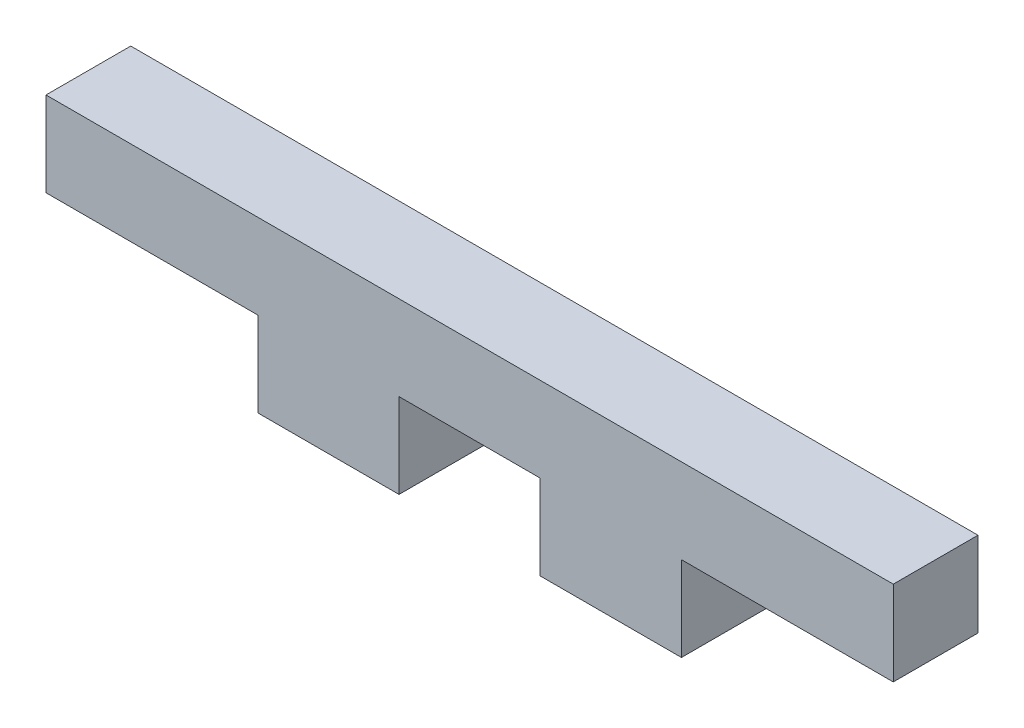
ISO-10303-21;
HEADER;
FILE_DESCRIPTION(('STEP AP214'),'2;1');
FILE_NAME('part.step','',(''),(''),'','','');
FILE_SCHEMA(('AUTOMOTIVE_DESIGN { 1 0 10303 214 1 1 1 1 }'));
ENDSEC;
DATA;
#1=APPLICATION_CONTEXT('core data for automotive mechanical design processes');
#2=APPLICATION_PROTOCOL_DEFINITION('international standard','automotive_design',2000,#1);
#3=PRODUCT_CONTEXT('',#1,'mechanical');
#4=PRODUCT('Part','Part','',(#3));
#5=PRODUCT_RELATED_PRODUCT_CATEGORY('part','',(#4));
#6=PRODUCT_DEFINITION_FORMATION('','',#4);
#7=PRODUCT_DEFINITION_CONTEXT('part definition',#1,'design');
#8=PRODUCT_DEFINITION('design','',#6,#7);
#9=PRODUCT_DEFINITION_SHAPE('','',#8);
#10=(LENGTH_UNIT() NAMED_UNIT(*) SI_UNIT(.MILLI.,.METRE.));
#11=(NAMED_UNIT(*) PLANE_ANGLE_UNIT() SI_UNIT($,.RADIAN.));
#12=(NAMED_UNIT(*) SI_UNIT($,.STERADIAN.) SOLID_ANGLE_UNIT());
#13=UNCERTAINTY_MEASURE_WITH_UNIT(LENGTH_MEASURE(1.E-05),#10,'distance_accuracy_value','');
#14=(GEOMETRIC_REPRESENTATION_CONTEXT(3) GLOBAL_UNCERTAINTY_ASSIGNED_CONTEXT((#13)) GLOBAL_UNIT_ASSIGNED_CONTEXT((#10,
#11,#12)) REPRESENTATION_CONTEXT('',''));
#15=CARTESIAN_POINT('',(0.,0.,0.));
#16=DIRECTION('',(0.,0.,1.));
#17=DIRECTION('',(1.,0.,0.));
#18=AXIS2_PLACEMENT_3D('',#15,#16,#17);
#19=CARTESIAN_POINT('',(8.99010664219347,0.,3.));
#20=DIRECTION('',(1.,0.,0.));
#21=DIRECTION('',(0.,1.,0.));
#22=AXIS2_PLACEMENT_3D('',#19,#20,#21);
#23=PLANE('',#22);
#24=DIRECTION('',(0.,-1.,0.));
#25=VECTOR('',#24,1.);
#26=CARTESIAN_POINT('',(8.99010664219347,0.,0.));
#27=LINE('',#26,#25);
#28=CARTESIAN_POINT('',(8.99010664219347,0.100430327009229,0.));
#29=VERTEX_POINT('',#28);
#30=CARTESIAN_POINT('',(8.99010664219347,-2.89956967299077,0.));
#31=VERTEX_POINT('',#30);
#32=EDGE_CURVE('E203',#29,#31,#27,.T.);
#33=ORIENTED_EDGE('',*,*,#32,.F.);
#34=DIRECTION('',(0.,0.,-1.));
#35=VECTOR('',#34,1.);
#36=CARTESIAN_POINT('',(8.99010664219347,0.100430327009229,3.));
#37=LINE('',#36,#35);
#38=CARTESIAN_POINT('',(8.99010664219347,0.100430327009229,3.));
#39=VERTEX_POINT('',#38);
#40=EDGE_CURVE('E11',#39,#29,#37,.T.);
#41=ORIENTED_EDGE('',*,*,#40,.F.);
#42=DIRECTION('',(0.,-1.,0.));
#43=VECTOR('',#42,1.);
#44=CARTESIAN_POINT('',(8.99010664219347,0.,3.));
#45=LINE('',#44,#43);
#46=CARTESIAN_POINT('',(8.99010664219347,-2.89956967299077,3.));
#47=VERTEX_POINT('',#46);
#48=EDGE_CURVE('E158',#39,#47,#45,.T.);
#49=ORIENTED_EDGE('',*,*,#48,.T.);
#50=DIRECTION('',(0.,0.,-1.));
#51=VECTOR('',#50,1.);
#52=CARTESIAN_POINT('',(8.99010664219347,-2.89956967299077,3.));
#53=LINE('',#52,#51);
#54=EDGE_CURVE('E97',#47,#31,#53,.T.);
#55=ORIENTED_EDGE('',*,*,#54,.T.);
#56=EDGE_LOOP('',(#33,#41,#49,#55));
#57=FACE_BOUND('',#56,.T.);
#58=ADVANCED_FACE('F35',(#57),#23,.T.);
#59=CARTESIAN_POINT('',(0.,0.100430327009226,3.));
#60=DIRECTION('',(0.,-1.,0.));
#61=DIRECTION('',(1.,0.,0.));
#62=AXIS2_PLACEMENT_3D('',#59,#60,#61);
#63=PLANE('',#62);
#64=DIRECTION('',(-1.,0.,0.));
#65=VECTOR('',#64,1.);
#66=CARTESIAN_POINT('',(0.,0.100430327009226,0.));
#67=LINE('',#66,#65);
#68=CARTESIAN_POINT('',(13.9901066421935,0.10043032700923,0.));
#69=VERTEX_POINT('',#68);
#70=EDGE_CURVE('E197',#69,#29,#67,.T.);
#71=ORIENTED_EDGE('',*,*,#70,.F.);
#72=DIRECTION('',(0.,0.,-1.));
#73=VECTOR('',#72,1.);
#74=CARTESIAN_POINT('',(13.9901066421935,0.10043032700923,3.));
#75=LINE('',#74,#73);
#76=CARTESIAN_POINT('',(13.9901066421935,0.10043032700923,3.));
#77=VERTEX_POINT('',#76);
#78=EDGE_CURVE('E43',#77,#69,#75,.T.);
#79=ORIENTED_EDGE('',*,*,#78,.F.);
#80=DIRECTION('',(-1.,0.,0.));
#81=VECTOR('',#80,1.);
#82=CARTESIAN_POINT('',(0.,0.100430327009226,3.));
#83=LINE('',#82,#81);
#84=EDGE_CURVE('E148',#77,#39,#83,.T.);
#85=ORIENTED_EDGE('',*,*,#84,.T.);
#86=ORIENTED_EDGE('',*,*,#40,.T.);
#87=EDGE_LOOP('',(#71,#79,#85,#86));
#88=FACE_BOUND('',#87,.T.);
#89=ADVANCED_FACE('F202',(#88),#63,.T.);
#90=CARTESIAN_POINT('',(13.9901066421935,0.,3.));
#91=DIRECTION('',(1.,0.,0.));
#92=DIRECTION('',(0.,0.,-1.));
#93=AXIS2_PLACEMENT_3D('',#90,#91,#92);
#94=PLANE('',#93);
#95=DIRECTION('',(0.,-1.,0.));
#96=VECTOR('',#95,1.);
#97=CARTESIAN_POINT('',(13.9901066421935,0.,0.));
#98=LINE('',#97,#96);
#99=CARTESIAN_POINT('',(13.9901066421935,-2.89956967299077,0.));
#100=VERTEX_POINT('',#99);
#101=EDGE_CURVE('E191',#69,#100,#98,.T.);
#102=ORIENTED_EDGE('',*,*,#101,.T.);
#103=DIRECTION('',(0.,0.,-1.));
#104=VECTOR('',#103,1.);
#105=CARTESIAN_POINT('',(13.9901066421935,-2.89956967299077,3.));
#106=LINE('',#105,#104);
#107=CARTESIAN_POINT('',(13.9901066421935,-2.89956967299077,3.));
#108=VERTEX_POINT('',#107);
#109=EDGE_CURVE('E184',#108,#100,#106,.T.);
#110=ORIENTED_EDGE('',*,*,#109,.F.);
#111=DIRECTION('',(0.,-1.,0.));
#112=VECTOR('',#111,1.);
#113=CARTESIAN_POINT('',(13.9901066421935,0.,3.));
#114=LINE('',#113,#112);
#115=EDGE_CURVE('E157',#77,#108,#114,.T.);
#116=ORIENTED_EDGE('',*,*,#115,.F.);
#117=ORIENTED_EDGE('',*,*,#78,.T.);
#118=EDGE_LOOP('',(#102,#110,#116,#117));
#119=FACE_BOUND('',#118,.T.);
#120=ADVANCED_FACE('F189',(#119),#94,.F.);
#121=CARTESIAN_POINT('',(0.,-2.89956967299077,3.));
#122=DIRECTION('',(0.,1.,0.));
#123=DIRECTION('',(-1.,0.,0.));
#124=AXIS2_PLACEMENT_3D('',#121,#122,#123);
#125=PLANE('',#124);
#126=DIRECTION('',(1.,0.,0.));
#127=VECTOR('',#126,1.);
#128=CARTESIAN_POINT('',(0.,-2.89956967299077,0.));
#129=LINE('',#128,#127);
#130=CARTESIAN_POINT('',(18.9901066421935,-2.89956967299077,0.));
#131=VERTEX_POINT('',#130);
#132=EDGE_CURVE('E200',#100,#131,#129,.T.);
#133=ORIENTED_EDGE('',*,*,#132,.T.);
#134=DIRECTION('',(0.,0.,-1.));
#135=VECTOR('',#134,1.);
#136=CARTESIAN_POINT('',(18.9901066421935,-2.89956967299077,3.));
#137=LINE('',#136,#135);
#138=CARTESIAN_POINT('',(18.9901066421935,-2.89956967299077,3.));
#139=VERTEX_POINT('',#138);
#140=EDGE_CURVE('E182',#139,#131,#137,.T.);
#141=ORIENTED_EDGE('',*,*,#140,.F.);
#142=DIRECTION('',(1.,0.,0.));
#143=VECTOR('',#142,1.);
#144=CARTESIAN_POINT('',(0.,-2.89956967299077,3.));
#145=LINE('',#144,#143);
#146=EDGE_CURVE('E161',#108,#139,#145,.T.);
#147=ORIENTED_EDGE('',*,*,#146,.F.);
#148=ORIENTED_EDGE('',*,*,#109,.T.);
#149=EDGE_LOOP('',(#133,#141,#147,#148));
#150=FACE_BOUND('',#149,.T.);
#151=ADVANCED_FACE('F234',(#150),#125,.F.);
#152=CARTESIAN_POINT('',(18.9901066421935,0.,3.));
#153=DIRECTION('',(1.,0.,0.));
#154=DIRECTION('',(0.,1.,0.));
#155=AXIS2_PLACEMENT_3D('',#152,#153,#154);
#156=PLANE('',#155);
#157=DIRECTION('',(0.,-1.,0.));
#158=VECTOR('',#157,1.);
#159=CARTESIAN_POINT('',(18.9901066421935,0.,0.));
#160=LINE('',#159,#158);
#161=CARTESIAN_POINT('',(18.9901066421935,0.100430327009229,0.));
#162=VERTEX_POINT('',#161);
#163=EDGE_CURVE('E210',#162,#131,#160,.T.);
#164=ORIENTED_EDGE('',*,*,#163,.F.);
#165=DIRECTION('',(0.,0.,-1.));
#166=VECTOR('',#165,1.);
#167=CARTESIAN_POINT('',(18.9901066421935,0.100430327009229,3.));
#168=LINE('',#167,#166);
#169=CARTESIAN_POINT('',(18.9901066421935,0.100430327009229,3.));
#170=VERTEX_POINT('',#169);
#171=EDGE_CURVE('E180',#170,#162,#168,.T.);
#172=ORIENTED_EDGE('',*,*,#171,.F.);
#173=DIRECTION('',(0.,-1.,0.));
#174=VECTOR('',#173,1.);
#175=CARTESIAN_POINT('',(18.9901066421935,0.,3.));
#176=LINE('',#175,#174);
#177=EDGE_CURVE('E155',#170,#139,#176,.T.);
#178=ORIENTED_EDGE('',*,*,#177,.T.);
#179=ORIENTED_EDGE('',*,*,#140,.T.);
#180=EDGE_LOOP('',(#164,#172,#178,#179));
#181=FACE_BOUND('',#180,.T.);
#182=ADVANCED_FACE('F239',(#181),#156,.T.);
#183=CARTESIAN_POINT('',(26.4901066421935,0.10043032700923,0.));
#184=VERTEX_POINT('',#183);
#185=EDGE_CURVE('E205',#184,#162,#67,.T.);
#186=ORIENTED_EDGE('',*,*,#185,.F.);
#187=DIRECTION('',(0.,0.,-1.));
#188=VECTOR('',#187,1.);
#189=CARTESIAN_POINT('',(26.4901066421935,0.10043032700923,3.));
#190=LINE('',#189,#188);
#191=CARTESIAN_POINT('',(26.4901066421935,0.10043032700923,3.));
#192=VERTEX_POINT('',#191);
#193=EDGE_CURVE('E178',#192,#184,#190,.T.);
#194=ORIENTED_EDGE('',*,*,#193,.F.);
#195=EDGE_CURVE('E147',#192,#170,#83,.T.);
#196=ORIENTED_EDGE('',*,*,#195,.T.);
#197=ORIENTED_EDGE('',*,*,#171,.T.);
#198=EDGE_LOOP('',(#186,#194,#196,#197));
#199=FACE_BOUND('',#198,.T.);
#200=ADVANCED_FACE('F230',(#199),#63,.T.);
#201=CARTESIAN_POINT('',(26.4901066421935,0.,3.));
#202=DIRECTION('',(1.,0.,0.));
#203=DIRECTION('',(0.,0.,-1.));
#204=AXIS2_PLACEMENT_3D('',#201,#202,#203);
#205=PLANE('',#204);
#206=DIRECTION('',(0.,-1.,0.));
#207=VECTOR('',#206,1.);
#208=CARTESIAN_POINT('',(26.4901066421935,0.,0.));
#209=LINE('',#208,#207);
#210=CARTESIAN_POINT('',(26.4901066421935,3.10043032700923,0.));
#211=VERTEX_POINT('',#210);
#212=EDGE_CURVE('E209',#211,#184,#209,.T.);
#213=ORIENTED_EDGE('',*,*,#212,.F.);
#214=DIRECTION('',(0.,0.,-1.));
#215=VECTOR('',#214,1.);
#216=CARTESIAN_POINT('',(26.4901066421935,3.10043032700923,3.));
#217=LINE('',#216,#215);
#218=CARTESIAN_POINT('',(26.4901066421935,3.10043032700923,3.));
#219=VERTEX_POINT('',#218);
#220=EDGE_CURVE('E176',#219,#211,#217,.T.);
#221=ORIENTED_EDGE('',*,*,#220,.F.);
#222=DIRECTION('',(0.,-1.,0.));
#223=VECTOR('',#222,1.);
#224=CARTESIAN_POINT('',(26.4901066421935,0.,3.));
#225=LINE('',#224,#223);
#226=EDGE_CURVE('E154',#219,#192,#225,.T.);
#227=ORIENTED_EDGE('',*,*,#226,.T.);
#228=ORIENTED_EDGE('',*,*,#193,.T.);
#229=EDGE_LOOP('',(#213,#221,#227,#228));
#230=FACE_BOUND('',#229,.T.);
#231=ADVANCED_FACE('F238',(#230),#205,.T.);
#232=CARTESIAN_POINT('',(0.,3.10043032700923,3.));
#233=DIRECTION('',(0.,-1.,0.));
#234=DIRECTION('',(1.,0.,0.));
#235=AXIS2_PLACEMENT_3D('',#232,#233,#234);
#236=PLANE('',#235);
#237=DIRECTION('',(-1.,0.,0.));
#238=VECTOR('',#237,1.);
#239=CARTESIAN_POINT('',(0.,3.10043032700923,0.));
#240=LINE('',#239,#238);
#241=CARTESIAN_POINT('',(-3.50989335780653,3.10043032700923,0.));
#242=VERTEX_POINT('',#241);
#243=EDGE_CURVE('E213',#211,#242,#240,.T.);
#244=ORIENTED_EDGE('',*,*,#243,.T.);
#245=DIRECTION('',(0.,0.,-1.));
#246=VECTOR('',#245,1.);
#247=CARTESIAN_POINT('',(-3.50989335780653,3.10043032700923,3.));
#248=LINE('',#247,#246);
#249=CARTESIAN_POINT('',(-3.50989335780653,3.10043032700923,3.));
#250=VERTEX_POINT('',#249);
#251=EDGE_CURVE('E173',#250,#242,#248,.T.);
#252=ORIENTED_EDGE('',*,*,#251,.F.);
#253=DIRECTION('',(-1.,0.,0.));
#254=VECTOR('',#253,1.);
#255=CARTESIAN_POINT('',(0.,3.10043032700923,3.));
#256=LINE('',#255,#254);
#257=EDGE_CURVE('E149',#219,#250,#256,.T.);
#258=ORIENTED_EDGE('',*,*,#257,.F.);
#259=ORIENTED_EDGE('',*,*,#220,.T.);
#260=EDGE_LOOP('',(#244,#252,#258,#259));
#261=FACE_BOUND('',#260,.T.);
#262=ADVANCED_FACE('F247',(#261),#236,.F.);
#263=CARTESIAN_POINT('',(-3.50989335780653,0.,3.));
#264=DIRECTION('',(1.,0.,0.));
#265=DIRECTION('',(0.,1.,0.));
#266=AXIS2_PLACEMENT_3D('',#263,#264,#265);
#267=PLANE('',#266);
#268=DIRECTION('',(0.,-1.,0.));
#269=VECTOR('',#268,1.);
#270=CARTESIAN_POINT('',(-3.50989335780653,0.,0.));
#271=LINE('',#270,#269);
#272=CARTESIAN_POINT('',(-3.50989335780653,0.100430327009226,0.));
#273=VERTEX_POINT('',#272);
#274=EDGE_CURVE('E207',#242,#273,#271,.T.);
#275=ORIENTED_EDGE('',*,*,#274,.T.);
#276=DIRECTION('',(0.,0.,-1.));
#277=VECTOR('',#276,1.);
#278=CARTESIAN_POINT('',(-3.50989335780653,0.100430327009226,3.));
#279=LINE('',#278,#277);
#280=CARTESIAN_POINT('',(-3.50989335780653,0.100430327009226,3.));
#281=VERTEX_POINT('',#280);
#282=EDGE_CURVE('E136',#281,#273,#279,.T.);
#283=ORIENTED_EDGE('',*,*,#282,.F.);
#284=DIRECTION('',(0.,-1.,0.));
#285=VECTOR('',#284,1.);
#286=CARTESIAN_POINT('',(-3.50989335780653,0.,3.));
#287=LINE('',#286,#285);
#288=EDGE_CURVE('E144',#250,#281,#287,.T.);
#289=ORIENTED_EDGE('',*,*,#288,.F.);
#290=ORIENTED_EDGE('',*,*,#251,.T.);
#291=EDGE_LOOP('',(#275,#283,#289,#290));
#292=FACE_BOUND('',#291,.T.);
#293=ADVANCED_FACE('F222',(#292),#267,.F.);
#294=CARTESIAN_POINT('',(3.99010664219347,0.100430327009229,0.));
#295=VERTEX_POINT('',#294);
#296=EDGE_CURVE('E135',#295,#273,#67,.T.);
#297=ORIENTED_EDGE('',*,*,#296,.F.);
#298=DIRECTION('',(0.,0.,-1.));
#299=VECTOR('',#298,1.);
#300=CARTESIAN_POINT('',(3.99010664219347,0.100430327009229,3.));
#301=LINE('',#300,#299);
#302=CARTESIAN_POINT('',(3.99010664219347,0.100430327009229,3.));
#303=VERTEX_POINT('',#302);
#304=EDGE_CURVE('E129',#303,#295,#301,.T.);
#305=ORIENTED_EDGE('',*,*,#304,.F.);
#306=EDGE_CURVE('E133',#303,#281,#83,.T.);
#307=ORIENTED_EDGE('',*,*,#306,.T.);
#308=ORIENTED_EDGE('',*,*,#282,.T.);
#309=EDGE_LOOP('',(#297,#305,#307,#308));
#310=FACE_BOUND('',#309,.T.);
#311=ADVANCED_FACE('F131',(#310),#63,.T.);
#312=CARTESIAN_POINT('',(3.99010664219347,0.,3.));
#313=DIRECTION('',(1.,0.,0.));
#314=DIRECTION('',(0.,1.,0.));
#315=AXIS2_PLACEMENT_3D('',#312,#313,#314);
#316=PLANE('',#315);
#317=DIRECTION('',(0.,-1.,0.));
#318=VECTOR('',#317,1.);
#319=CARTESIAN_POINT('',(3.99010664219347,0.,0.));
#320=LINE('',#319,#318);
#321=CARTESIAN_POINT('',(3.99010664219347,-2.89956967299077,0.));
#322=VERTEX_POINT('',#321);
#323=EDGE_CURVE('E90',#295,#322,#320,.T.);
#324=ORIENTED_EDGE('',*,*,#323,.T.);
#325=DIRECTION('',(0.,0.,-1.));
#326=VECTOR('',#325,1.);
#327=CARTESIAN_POINT('',(3.99010664219347,-2.89956967299077,3.));
#328=LINE('',#327,#326);
#329=CARTESIAN_POINT('',(3.99010664219347,-2.89956967299077,3.));
#330=VERTEX_POINT('',#329);
#331=EDGE_CURVE('E137',#330,#322,#328,.T.);
#332=ORIENTED_EDGE('',*,*,#331,.F.);
#333=DIRECTION('',(0.,-1.,0.));
#334=VECTOR('',#333,1.);
#335=CARTESIAN_POINT('',(3.99010664219347,0.,3.));
#336=LINE('',#335,#334);
#337=EDGE_CURVE('E139',#303,#330,#336,.T.);
#338=ORIENTED_EDGE('',*,*,#337,.F.);
#339=ORIENTED_EDGE('',*,*,#304,.T.);
#340=EDGE_LOOP('',(#324,#332,#338,#339));
#341=FACE_BOUND('',#340,.T.);
#342=ADVANCED_FACE('F140',(#341),#316,.F.);
#343=CARTESIAN_POINT('',(0.,-2.89956967299077,3.));
#344=DIRECTION('',(0.,1.,0.));
#345=DIRECTION('',(-1.,0.,0.));
#346=AXIS2_PLACEMENT_3D('',#343,#344,#345);
#347=PLANE('',#346);
#348=DIRECTION('',(1.,0.,0.));
#349=VECTOR('',#348,1.);
#350=CARTESIAN_POINT('',(0.,-2.89956967299077,0.));
#351=LINE('',#350,#349);
#352=EDGE_CURVE('E162',#322,#31,#351,.T.);
#353=ORIENTED_EDGE('',*,*,#352,.T.);
#354=ORIENTED_EDGE('',*,*,#54,.F.);
#355=DIRECTION('',(1.,0.,0.));
#356=VECTOR('',#355,1.);
#357=CARTESIAN_POINT('',(0.,-2.89956967299077,3.));
#358=LINE('',#357,#356);
#359=EDGE_CURVE('E51',#330,#47,#358,.T.);
#360=ORIENTED_EDGE('',*,*,#359,.F.);
#361=ORIENTED_EDGE('',*,*,#331,.T.);
#362=EDGE_LOOP('',(#353,#354,#360,#361));
#363=FACE_BOUND('',#362,.T.);
#364=ADVANCED_FACE('F246',(#363),#347,.F.);
#365=CARTESIAN_POINT('',(0.,0.,3.));
#366=DIRECTION('',(0.,0.,1.));
#367=DIRECTION('',(1.,0.,0.));
#368=AXIS2_PLACEMENT_3D('',#365,#366,#367);
#369=PLANE('',#368);
#370=ORIENTED_EDGE('',*,*,#48,.F.);
#371=ORIENTED_EDGE('',*,*,#84,.F.);
#372=ORIENTED_EDGE('',*,*,#115,.T.);
#373=ORIENTED_EDGE('',*,*,#146,.T.);
#374=ORIENTED_EDGE('',*,*,#177,.F.);
#375=ORIENTED_EDGE('',*,*,#195,.F.);
#376=ORIENTED_EDGE('',*,*,#226,.F.);
#377=ORIENTED_EDGE('',*,*,#257,.T.);
#378=ORIENTED_EDGE('',*,*,#288,.T.);
#379=ORIENTED_EDGE('',*,*,#306,.F.);
#380=ORIENTED_EDGE('',*,*,#337,.T.);
#381=ORIENTED_EDGE('',*,*,#359,.T.);
#382=EDGE_LOOP('',(#370,#371,#372,#373,#374,#375,#376,#377,#378,#379,#380,#381));
#383=FACE_BOUND('',#382,.T.);
#384=ADVANCED_FACE('F142',(#383),#369,.T.);
#385=CARTESIAN_POINT('',(0.,0.,0.));
#386=DIRECTION('',(0.,0.,1.));
#387=DIRECTION('',(1.,0.,0.));
#388=AXIS2_PLACEMENT_3D('',#385,#386,#387);
#389=PLANE('',#388);
#390=ORIENTED_EDGE('',*,*,#32,.T.);
#391=ORIENTED_EDGE('',*,*,#352,.F.);
#392=ORIENTED_EDGE('',*,*,#323,.F.);
#393=ORIENTED_EDGE('',*,*,#296,.T.);
#394=ORIENTED_EDGE('',*,*,#274,.F.);
#395=ORIENTED_EDGE('',*,*,#243,.F.);
#396=ORIENTED_EDGE('',*,*,#212,.T.);
#397=ORIENTED_EDGE('',*,*,#185,.T.);
#398=ORIENTED_EDGE('',*,*,#163,.T.);
#399=ORIENTED_EDGE('',*,*,#132,.F.);
#400=ORIENTED_EDGE('',*,*,#101,.F.);
#401=ORIENTED_EDGE('',*,*,#70,.T.);
#402=EDGE_LOOP('',(#390,#391,#392,#393,#394,#395,#396,#397,#398,#399,#400,#401));
#403=FACE_BOUND('',#402,.T.);
#404=ADVANCED_FACE('F196',(#403),#389,.F.);
#405=CLOSED_SHELL('',(#58,#89,#120,#151,#182,#200,#231,#262,#293,#311,#342,#364,#384,#404));
#406=MANIFOLD_SOLID_BREP('B2',#405);
#407=ADVANCED_BREP_SHAPE_REPRESENTATION('',(#18,#406),#14);
#408=SHAPE_DEFINITION_REPRESENTATION(#9,#407);
ENDSEC;
END-ISO-10303-21;
